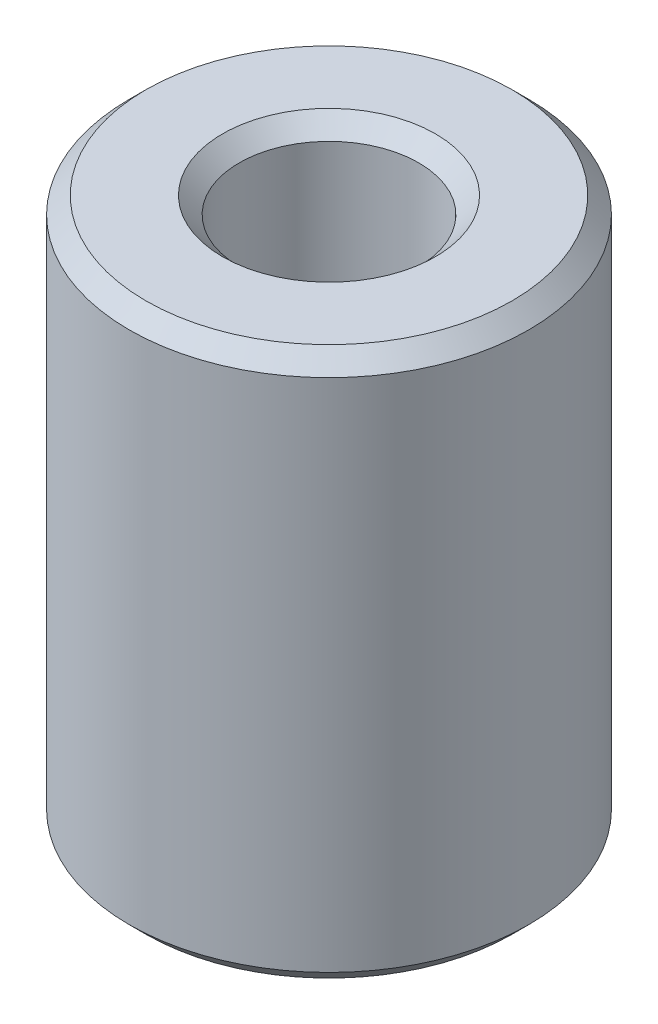
ISO-10303-21;
HEADER;
FILE_DESCRIPTION(('STEP AP214'),'2;1');
FILE_NAME('part.step','',(''),(''),'','','');
FILE_SCHEMA(('AUTOMOTIVE_DESIGN { 1 0 10303 214 1 1 1 1 }'));
ENDSEC;
DATA;
#1=APPLICATION_CONTEXT('core data for automotive mechanical design processes');
#2=APPLICATION_PROTOCOL_DEFINITION('international standard','automotive_design',2000,#1);
#3=PRODUCT_CONTEXT('',#1,'mechanical');
#4=PRODUCT('Part','Part','',(#3));
#5=PRODUCT_RELATED_PRODUCT_CATEGORY('part','',(#4));
#6=PRODUCT_DEFINITION_FORMATION('','',#4);
#7=PRODUCT_DEFINITION_CONTEXT('part definition',#1,'design');
#8=PRODUCT_DEFINITION('design','',#6,#7);
#9=PRODUCT_DEFINITION_SHAPE('','',#8);
#10=(LENGTH_UNIT() NAMED_UNIT(*) SI_UNIT(.MILLI.,.METRE.));
#11=(NAMED_UNIT(*) PLANE_ANGLE_UNIT() SI_UNIT($,.RADIAN.));
#12=(NAMED_UNIT(*) SI_UNIT($,.STERADIAN.) SOLID_ANGLE_UNIT());
#13=UNCERTAINTY_MEASURE_WITH_UNIT(LENGTH_MEASURE(1.E-05),#10,'distance_accuracy_value','');
#14=(GEOMETRIC_REPRESENTATION_CONTEXT(3) GLOBAL_UNCERTAINTY_ASSIGNED_CONTEXT((#13)) GLOBAL_UNIT_ASSIGNED_CONTEXT((#10,
#11,#12)) REPRESENTATION_CONTEXT('',''));
#15=CARTESIAN_POINT('',(0.,0.,0.));
#16=DIRECTION('',(0.,0.,1.));
#17=DIRECTION('',(1.,0.,0.));
#18=AXIS2_PLACEMENT_3D('',#15,#16,#17);
#19=CARTESIAN_POINT('',(0.,41.2006537535754,0.));
#20=DIRECTION('',(0.,-1.,0.));
#21=DIRECTION('',(0.,0.,-1.));
#22=AXIS2_PLACEMENT_3D('',#19,#20,#21);
#23=CYLINDRICAL_SURFACE('',#22,15.);
#24=CARTESIAN_POINT('',(0.,1.25679006340886,0.));
#25=DIRECTION('',(0.,1.,0.));
#26=DIRECTION('',(0.,0.,1.));
#27=AXIS2_PLACEMENT_3D('',#24,#25,#26);
#28=CIRCLE('',#27,15.);
#29=CARTESIAN_POINT('',(0.,1.25679006340886,15.));
#30=VERTEX_POINT('',#29);
#31=EDGE_CURVE('E10',#30,#30,#28,.T.);
#32=ORIENTED_EDGE('',*,*,#31,.T.);
#33=EDGE_LOOP('',(#32));
#34=FACE_BOUND('',#33,.T.);
#35=CARTESIAN_POINT('',(0.,39.9438636901665,0.));
#36=DIRECTION('',(0.,1.,0.));
#37=DIRECTION('',(0.,0.,1.));
#38=AXIS2_PLACEMENT_3D('',#35,#36,#37);
#39=CIRCLE('',#38,15.);
#40=CARTESIAN_POINT('',(0.,39.9438636901665,15.));
#41=VERTEX_POINT('',#40);
#42=EDGE_CURVE('E50',#41,#41,#39,.F.);
#43=ORIENTED_EDGE('',*,*,#42,.T.);
#44=EDGE_LOOP('',(#43));
#45=FACE_BOUND('',#44,.T.);
#46=ADVANCED_FACE('F39',(#34,#45),#23,.T.);
#47=CARTESIAN_POINT('',(0.,41.2006537535754,0.));
#48=DIRECTION('',(0.,1.,0.));
#49=DIRECTION('',(0.,0.,1.));
#50=AXIS2_PLACEMENT_3D('',#47,#48,#49);
#51=PLANE('',#50);
#52=CARTESIAN_POINT('',(0.,41.2006537535754,0.));
#53=DIRECTION('',(0.,1.,0.));
#54=DIRECTION('',(0.,0.,1.));
#55=AXIS2_PLACEMENT_3D('',#52,#53,#54);
#56=CIRCLE('',#55,7.9974404219508);
#57=CARTESIAN_POINT('',(0.,41.2006537535754,7.9974404219508));
#58=VERTEX_POINT('',#57);
#59=EDGE_CURVE('E58',#58,#58,#56,.F.);
#60=ORIENTED_EDGE('',*,*,#59,.T.);
#61=EDGE_LOOP('',(#60));
#62=FACE_BOUND('',#61,.T.);
#63=CARTESIAN_POINT('',(0.,41.2006537535754,0.));
#64=DIRECTION('',(0.,1.,0.));
#65=DIRECTION('',(0.,0.,1.));
#66=AXIS2_PLACEMENT_3D('',#63,#64,#65);
#67=CIRCLE('',#66,13.7432099365911);
#68=CARTESIAN_POINT('',(0.,41.2006537535754,13.7432099365911));
#69=VERTEX_POINT('',#68);
#70=EDGE_CURVE('E61',#69,#69,#67,.T.);
#71=ORIENTED_EDGE('',*,*,#70,.T.);
#72=EDGE_LOOP('',(#71));
#73=FACE_BOUND('',#72,.T.);
#74=ADVANCED_FACE('F88',(#62,#73),#51,.T.);
#75=CARTESIAN_POINT('',(0.,0.,0.));
#76=DIRECTION('',(0.,1.,0.));
#77=DIRECTION('',(0.,0.,1.));
#78=AXIS2_PLACEMENT_3D('',#75,#76,#77);
#79=PLANE('',#78);
#80=CARTESIAN_POINT('',(0.,0.,0.));
#81=DIRECTION('',(0.,1.,0.));
#82=DIRECTION('',(0.,0.,1.));
#83=AXIS2_PLACEMENT_3D('',#80,#81,#82);
#84=CIRCLE('',#83,7.99744042195075);
#85=CARTESIAN_POINT('',(0.,0.,7.99744042195075));
#86=VERTEX_POINT('',#85);
#87=EDGE_CURVE('E51',#86,#86,#84,.T.);
#88=ORIENTED_EDGE('',*,*,#87,.T.);
#89=EDGE_LOOP('',(#88));
#90=FACE_BOUND('',#89,.T.);
#91=CARTESIAN_POINT('',(0.,0.,0.));
#92=DIRECTION('',(0.,1.,0.));
#93=DIRECTION('',(0.,0.,1.));
#94=AXIS2_PLACEMENT_3D('',#91,#92,#93);
#95=CIRCLE('',#94,13.7432099365911);
#96=CARTESIAN_POINT('',(0.,0.,13.7432099365911));
#97=VERTEX_POINT('',#96);
#98=EDGE_CURVE('E54',#97,#97,#95,.F.);
#99=ORIENTED_EDGE('',*,*,#98,.T.);
#100=EDGE_LOOP('',(#99));
#101=FACE_BOUND('',#100,.T.);
#102=ADVANCED_FACE('F83',(#90,#101),#79,.F.);
#103=CARTESIAN_POINT('',(0.,41.2006537535754,0.));
#104=DIRECTION('',(0.,-1.,0.));
#105=DIRECTION('',(0.,0.,-1.));
#106=AXIS2_PLACEMENT_3D('',#103,#104,#105);
#107=CYLINDRICAL_SURFACE('',#106,6.74065035854189);
#108=CARTESIAN_POINT('',(0.,39.9438636901665,0.));
#109=DIRECTION('',(0.,1.,0.));
#110=DIRECTION('',(0.,0.,1.));
#111=AXIS2_PLACEMENT_3D('',#108,#109,#110);
#112=CIRCLE('',#111,6.74065035854189);
#113=CARTESIAN_POINT('',(0.,39.9438636901665,6.74065035854189));
#114=VERTEX_POINT('',#113);
#115=EDGE_CURVE('E67',#114,#114,#112,.T.);
#116=ORIENTED_EDGE('',*,*,#115,.T.);
#117=EDGE_LOOP('',(#116));
#118=FACE_BOUND('',#117,.T.);
#119=CARTESIAN_POINT('',(0.,1.25679006340888,0.));
#120=DIRECTION('',(0.,1.,0.));
#121=DIRECTION('',(0.,0.,1.));
#122=AXIS2_PLACEMENT_3D('',#119,#120,#121);
#123=CIRCLE('',#122,6.74065035854189);
#124=CARTESIAN_POINT('',(0.,1.25679006340888,6.74065035854189));
#125=VERTEX_POINT('',#124);
#126=EDGE_CURVE('E69',#125,#125,#123,.F.);
#127=ORIENTED_EDGE('',*,*,#126,.T.);
#128=EDGE_LOOP('',(#127));
#129=FACE_BOUND('',#128,.T.);
#130=ADVANCED_FACE('F71',(#118,#129),#107,.F.);
#131=CARTESIAN_POINT('',(0.,39.9438636901665,0.));
#132=DIRECTION('',(0.,1.,0.));
#133=DIRECTION('',(0.,0.,1.));
#134=AXIS2_PLACEMENT_3D('',#131,#132,#133);
#135=CONICAL_SURFACE('',#134,6.74065035854189,0.785398163397454);
#136=ORIENTED_EDGE('',*,*,#59,.F.);
#137=EDGE_LOOP('',(#136));
#138=FACE_BOUND('',#137,.T.);
#139=ORIENTED_EDGE('',*,*,#115,.F.);
#140=EDGE_LOOP('',(#139));
#141=FACE_BOUND('',#140,.T.);
#142=ADVANCED_FACE('F77',(#138,#141),#135,.F.);
#143=CARTESIAN_POINT('',(0.,0.,0.));
#144=DIRECTION('',(0.,-1.,0.));
#145=DIRECTION('',(0.,0.,-1.));
#146=AXIS2_PLACEMENT_3D('',#143,#144,#145);
#147=CONICAL_SURFACE('',#146,7.99744042195075,0.785398163397443);
#148=ORIENTED_EDGE('',*,*,#126,.F.);
#149=EDGE_LOOP('',(#148));
#150=FACE_BOUND('',#149,.T.);
#151=ORIENTED_EDGE('',*,*,#87,.F.);
#152=EDGE_LOOP('',(#151));
#153=FACE_BOUND('',#152,.T.);
#154=ADVANCED_FACE('F73',(#150,#153),#147,.F.);
#155=CARTESIAN_POINT('',(0.,1.25679006340886,0.));
#156=DIRECTION('',(0.,1.,0.));
#157=DIRECTION('',(0.,0.,1.));
#158=AXIS2_PLACEMENT_3D('',#155,#156,#157);
#159=CONICAL_SURFACE('',#158,15.,0.78539816339745);
#160=ORIENTED_EDGE('',*,*,#98,.F.);
#161=EDGE_LOOP('',(#160));
#162=FACE_BOUND('',#161,.T.);
#163=ORIENTED_EDGE('',*,*,#31,.F.);
#164=EDGE_LOOP('',(#163));
#165=FACE_BOUND('',#164,.T.);
#166=ADVANCED_FACE('F76',(#162,#165),#159,.T.);
#167=CARTESIAN_POINT('',(0.,41.2006537535754,0.));
#168=DIRECTION('',(0.,-1.,0.));
#169=DIRECTION('',(0.,0.,-1.));
#170=AXIS2_PLACEMENT_3D('',#167,#168,#169);
#171=CONICAL_SURFACE('',#170,13.7432099365911,0.785398163397443);
#172=ORIENTED_EDGE('',*,*,#42,.F.);
#173=EDGE_LOOP('',(#172));
#174=FACE_BOUND('',#173,.T.);
#175=ORIENTED_EDGE('',*,*,#70,.F.);
#176=EDGE_LOOP('',(#175));
#177=FACE_BOUND('',#176,.T.);
#178=ADVANCED_FACE('F45',(#174,#177),#171,.T.);
#179=CLOSED_SHELL('',(#46,#74,#102,#130,#142,#154,#166,#178));
#180=MANIFOLD_SOLID_BREP('B2',#179);
#181=ADVANCED_BREP_SHAPE_REPRESENTATION('',(#18,#180),#14);
#182=SHAPE_DEFINITION_REPRESENTATION(#9,#181);
ENDSEC;
END-ISO-10303-21;
